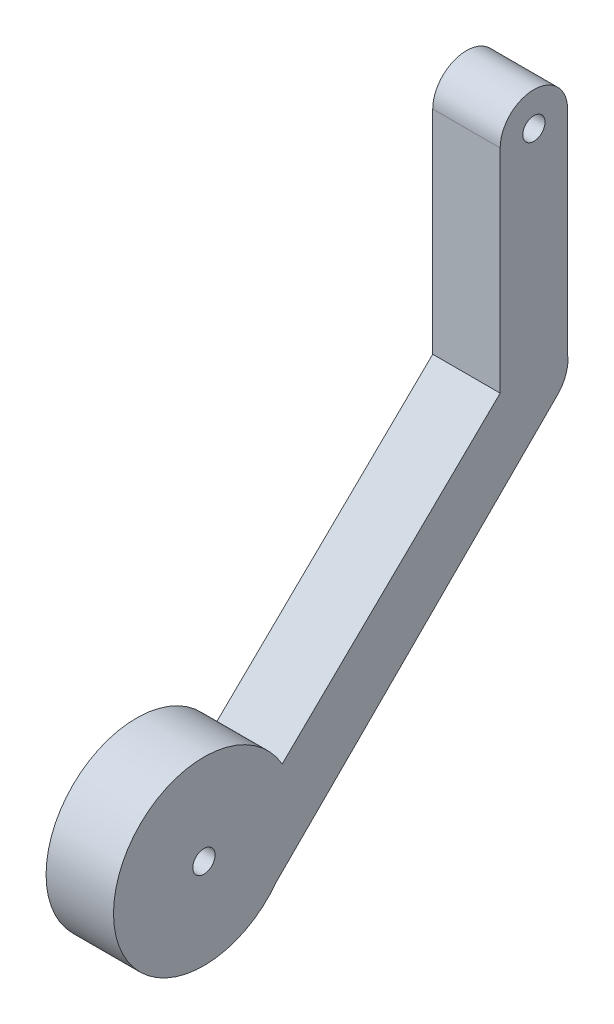
ISO-10303-21;
HEADER;
FILE_DESCRIPTION(('STEP AP214'),'2;1');
FILE_NAME('part.step','',(''),(''),'','','');
FILE_SCHEMA(('AUTOMOTIVE_DESIGN { 1 0 10303 214 1 1 1 1 }'));
ENDSEC;
DATA;
#1=APPLICATION_CONTEXT('core data for automotive mechanical design processes');
#2=APPLICATION_PROTOCOL_DEFINITION('international standard','automotive_design',2000,#1);
#3=PRODUCT_CONTEXT('',#1,'mechanical');
#4=PRODUCT('Part','Part','',(#3));
#5=PRODUCT_RELATED_PRODUCT_CATEGORY('part','',(#4));
#6=PRODUCT_DEFINITION_FORMATION('','',#4);
#7=PRODUCT_DEFINITION_CONTEXT('part definition',#1,'design');
#8=PRODUCT_DEFINITION('design','',#6,#7);
#9=PRODUCT_DEFINITION_SHAPE('','',#8);
#10=(LENGTH_UNIT() NAMED_UNIT(*) SI_UNIT(.MILLI.,.METRE.));
#11=(NAMED_UNIT(*) PLANE_ANGLE_UNIT() SI_UNIT($,.RADIAN.));
#12=(NAMED_UNIT(*) SI_UNIT($,.STERADIAN.) SOLID_ANGLE_UNIT());
#13=UNCERTAINTY_MEASURE_WITH_UNIT(LENGTH_MEASURE(1.E-05),#10,'distance_accuracy_value','');
#14=(GEOMETRIC_REPRESENTATION_CONTEXT(3) GLOBAL_UNCERTAINTY_ASSIGNED_CONTEXT((#13)) GLOBAL_UNIT_ASSIGNED_CONTEXT((#10,
#11,#12)) REPRESENTATION_CONTEXT('',''));
#15=CARTESIAN_POINT('',(0.,0.,0.));
#16=DIRECTION('',(0.,0.,1.));
#17=DIRECTION('',(1.,0.,0.));
#18=AXIS2_PLACEMENT_3D('',#15,#16,#17);
#19=CARTESIAN_POINT('',(66.4159242466974,-53.8689345190493,50.5552745681072));
#20=DIRECTION('',(1.,0.,0.));
#21=DIRECTION('',(0.,0.,-1.));
#22=AXIS2_PLACEMENT_3D('',#19,#20,#21);
#23=PLANE('',#22);
#24=CARTESIAN_POINT('',(66.4159242466974,-21.663090288847,50.2643924418796));
#25=DIRECTION('',(1.,0.,0.));
#26=DIRECTION('',(0.,0.,-1.));
#27=AXIS2_PLACEMENT_3D('',#24,#25,#26);
#28=CIRCLE('',#27,1.65);
#29=CARTESIAN_POINT('',(66.4159242466974,-21.663090288847,48.6143924418796));
#30=VERTEX_POINT('',#29);
#31=EDGE_CURVE('E128',#30,#30,#28,.T.);
#32=ORIENTED_EDGE('',*,*,#31,.F.);
#33=EDGE_LOOP('',(#32));
#34=FACE_BOUND('',#33,.T.);
#35=CARTESIAN_POINT('',(66.4159242466974,-53.8689345190493,50.5552745681072));
#36=DIRECTION('',(1.,0.,0.));
#37=DIRECTION('',(0.,0.,-1.));
#38=AXIS2_PLACEMENT_3D('',#35,#36,#37);
#39=CIRCLE('',#38,5.33901453140242);
#40=CARTESIAN_POINT('',(66.4159242466974,-57.6441878990574,46.7800211880989));
#41=VERTEX_POINT('',#40);
#42=CARTESIAN_POINT('',(66.4159242466974,-53.1536426255599,45.2643924418796));
#43=VERTEX_POINT('',#42);
#44=EDGE_CURVE('E137',#41,#43,#39,.T.);
#45=ORIENTED_EDGE('',*,*,#44,.T.);
#46=DIRECTION('',(0.,1.,0.));
#47=VECTOR('',#46,1.);
#48=CARTESIAN_POINT('',(66.4159242466974,-21.663090288847,45.2643924418796));
#49=LINE('',#48,#47);
#50=CARTESIAN_POINT('',(66.4159242466974,-21.663090288847,45.2643924418796));
#51=VERTEX_POINT('',#50);
#52=EDGE_CURVE('E90',#43,#51,#49,.T.);
#53=ORIENTED_EDGE('',*,*,#52,.T.);
#54=CARTESIAN_POINT('',(66.4159242466974,-21.663090288847,50.2643924418796));
#55=DIRECTION('',(1.,0.,0.));
#56=DIRECTION('',(0.,0.,-1.));
#57=AXIS2_PLACEMENT_3D('',#54,#55,#56);
#58=CIRCLE('',#57,5.);
#59=CARTESIAN_POINT('',(66.4159242466974,-21.663090288847,55.2643924418796));
#60=VERTEX_POINT('',#59);
#61=EDGE_CURVE('E149',#51,#60,#58,.T.);
#62=ORIENTED_EDGE('',*,*,#61,.T.);
#63=DIRECTION('',(0.,-1.,0.));
#64=VECTOR('',#63,1.);
#65=CARTESIAN_POINT('',(66.4159242466974,-21.663090288847,55.2643924418796));
#66=LINE('',#65,#64);
#67=CARTESIAN_POINT('',(66.4159242466974,-53.1536426255599,55.2643924418796));
#68=VERTEX_POINT('',#67);
#69=EDGE_CURVE('E106',#60,#68,#66,.T.);
#70=ORIENTED_EDGE('',*,*,#69,.T.);
#71=DIRECTION('',(0.,-0.697431400188519,0.716651548544397));
#72=VECTOR('',#71,1.);
#73=CARTESIAN_POINT('',(66.4159242466974,-53.1536426255599,55.2643924418796));
#74=LINE('',#73,#72);
#75=CARTESIAN_POINT('',(66.4159242466974,-84.6061686146855,87.5837021971429));
#76=VERTEX_POINT('',#75);
#77=EDGE_CURVE('E100',#68,#76,#74,.T.);
#78=ORIENTED_EDGE('',*,*,#77,.T.);
#79=CARTESIAN_POINT('',(66.4159242466974,-91.3091232544164,99.1903375295028));
#80=DIRECTION('',(1.,0.,0.));
#81=DIRECTION('',(0.,0.,1.));
#82=AXIS2_PLACEMENT_3D('',#79,#80,#81);
#83=CIRCLE('',#82,13.4031184670089);
#84=CARTESIAN_POINT('',(66.4159242466974,-99.2766570863032,88.4124903753437));
#85=VERTEX_POINT('',#84);
#86=EDGE_CURVE('E104',#76,#85,#83,.T.);
#87=ORIENTED_EDGE('',*,*,#86,.T.);
#88=DIRECTION('',(0.,0.707106781186556,-0.707106781186539));
#89=VECTOR('',#88,1.);
#90=CARTESIAN_POINT('',(66.4159242466974,-99.2766570863032,88.4124903753437));
#91=LINE('',#90,#89);
#92=EDGE_CURVE('E50',#85,#41,#91,.T.);
#93=ORIENTED_EDGE('',*,*,#92,.T.);
#94=EDGE_LOOP('',(#45,#53,#62,#70,#78,#87,#93));
#95=FACE_BOUND('',#94,.T.);
#96=CARTESIAN_POINT('',(66.4159242466974,-91.3091232544164,99.1903375295028));
#97=DIRECTION('',(1.,0.,0.));
#98=DIRECTION('',(0.,0.,-1.));
#99=AXIS2_PLACEMENT_3D('',#96,#97,#98);
#100=CIRCLE('',#99,1.65);
#101=CARTESIAN_POINT('',(66.4159242466974,-91.3091232544164,97.5403375295028));
#102=VERTEX_POINT('',#101);
#103=EDGE_CURVE('E164',#102,#102,#100,.T.);
#104=ORIENTED_EDGE('',*,*,#103,.F.);
#105=EDGE_LOOP('',(#104));
#106=FACE_BOUND('',#105,.T.);
#107=ADVANCED_FACE('F33',(#34,#95,#106),#23,.T.);
#108=CARTESIAN_POINT('',(56.4159242466974,-53.8689345190493,50.5552745681072));
#109=DIRECTION('',(1.,0.,0.));
#110=DIRECTION('',(0.,0.,-1.));
#111=AXIS2_PLACEMENT_3D('',#108,#109,#110);
#112=PLANE('',#111);
#113=CARTESIAN_POINT('',(56.4159242466974,-53.8689345190493,50.5552745681072));
#114=DIRECTION('',(1.,0.,0.));
#115=DIRECTION('',(0.,0.,-1.));
#116=AXIS2_PLACEMENT_3D('',#113,#114,#115);
#117=CIRCLE('',#116,5.33901453140242);
#118=CARTESIAN_POINT('',(56.4159242466974,-57.6441878990574,46.7800211880989));
#119=VERTEX_POINT('',#118);
#120=CARTESIAN_POINT('',(56.4159242466974,-53.1536426255599,45.2643924418796));
#121=VERTEX_POINT('',#120);
#122=EDGE_CURVE('E124',#119,#121,#117,.T.);
#123=ORIENTED_EDGE('',*,*,#122,.F.);
#124=DIRECTION('',(0.,0.707106781186556,-0.707106781186539));
#125=VECTOR('',#124,1.);
#126=CARTESIAN_POINT('',(56.4159242466974,-99.2766570863032,88.4124903753437));
#127=LINE('',#126,#125);
#128=CARTESIAN_POINT('',(56.4159242466974,-99.2766570863032,88.4124903753437));
#129=VERTEX_POINT('',#128);
#130=EDGE_CURVE('E82',#129,#119,#127,.T.);
#131=ORIENTED_EDGE('',*,*,#130,.F.);
#132=CARTESIAN_POINT('',(56.4159242466974,-91.3091232544164,99.1903375295028));
#133=DIRECTION('',(1.,0.,0.));
#134=DIRECTION('',(0.,0.,1.));
#135=AXIS2_PLACEMENT_3D('',#132,#133,#134);
#136=CIRCLE('',#135,13.4031184670089);
#137=CARTESIAN_POINT('',(56.4159242466974,-84.6061686146855,87.5837021971429));
#138=VERTEX_POINT('',#137);
#139=EDGE_CURVE('E76',#138,#129,#136,.T.);
#140=ORIENTED_EDGE('',*,*,#139,.F.);
#141=DIRECTION('',(0.,-0.697431400188519,0.716651548544397));
#142=VECTOR('',#141,1.);
#143=CARTESIAN_POINT('',(56.4159242466974,-53.1536426255599,55.2643924418796));
#144=LINE('',#143,#142);
#145=CARTESIAN_POINT('',(56.4159242466974,-53.1536426255599,55.2643924418796));
#146=VERTEX_POINT('',#145);
#147=EDGE_CURVE('E114',#146,#138,#144,.T.);
#148=ORIENTED_EDGE('',*,*,#147,.F.);
#149=DIRECTION('',(0.,-1.,0.));
#150=VECTOR('',#149,1.);
#151=CARTESIAN_POINT('',(56.4159242466974,-21.663090288847,55.2643924418796));
#152=LINE('',#151,#150);
#153=CARTESIAN_POINT('',(56.4159242466974,-21.663090288847,55.2643924418796));
#154=VERTEX_POINT('',#153);
#155=EDGE_CURVE('E132',#154,#146,#152,.T.);
#156=ORIENTED_EDGE('',*,*,#155,.F.);
#157=CARTESIAN_POINT('',(56.4159242466974,-21.663090288847,50.2643924418796));
#158=DIRECTION('',(1.,0.,0.));
#159=DIRECTION('',(0.,0.,-1.));
#160=AXIS2_PLACEMENT_3D('',#157,#158,#159);
#161=CIRCLE('',#160,5.);
#162=CARTESIAN_POINT('',(56.4159242466974,-21.663090288847,45.2643924418796));
#163=VERTEX_POINT('',#162);
#164=EDGE_CURVE('E130',#163,#154,#161,.T.);
#165=ORIENTED_EDGE('',*,*,#164,.F.);
#166=DIRECTION('',(0.,1.,0.));
#167=VECTOR('',#166,1.);
#168=CARTESIAN_POINT('',(56.4159242466974,-21.663090288847,45.2643924418796));
#169=LINE('',#168,#167);
#170=EDGE_CURVE('E127',#121,#163,#169,.T.);
#171=ORIENTED_EDGE('',*,*,#170,.F.);
#172=EDGE_LOOP('',(#123,#131,#140,#148,#156,#165,#171));
#173=FACE_BOUND('',#172,.T.);
#174=CARTESIAN_POINT('',(56.4159242466974,-21.663090288847,50.2643924418796));
#175=DIRECTION('',(1.,0.,0.));
#176=DIRECTION('',(0.,0.,-1.));
#177=AXIS2_PLACEMENT_3D('',#174,#175,#176);
#178=CIRCLE('',#177,1.65);
#179=CARTESIAN_POINT('',(56.4159242466974,-21.663090288847,48.6143924418796));
#180=VERTEX_POINT('',#179);
#181=EDGE_CURVE('E161',#180,#180,#178,.T.);
#182=ORIENTED_EDGE('',*,*,#181,.T.);
#183=EDGE_LOOP('',(#182));
#184=FACE_BOUND('',#183,.T.);
#185=CARTESIAN_POINT('',(56.4159242466974,-91.3091232544164,99.1903375295028));
#186=DIRECTION('',(1.,0.,0.));
#187=DIRECTION('',(0.,0.,-1.));
#188=AXIS2_PLACEMENT_3D('',#185,#186,#187);
#189=CIRCLE('',#188,1.65);
#190=CARTESIAN_POINT('',(56.4159242466974,-91.3091232544164,97.5403375295028));
#191=VERTEX_POINT('',#190);
#192=EDGE_CURVE('E167',#191,#191,#189,.T.);
#193=ORIENTED_EDGE('',*,*,#192,.T.);
#194=EDGE_LOOP('',(#193));
#195=FACE_BOUND('',#194,.T.);
#196=ADVANCED_FACE('F153',(#173,#184,#195),#112,.F.);
#197=CARTESIAN_POINT('',(66.4159242466974,-53.8689345190493,50.5552745681072));
#198=DIRECTION('',(-1.,0.,0.));
#199=DIRECTION('',(0.,0.,1.));
#200=AXIS2_PLACEMENT_3D('',#197,#198,#199);
#201=CYLINDRICAL_SURFACE('',#200,5.33901453140242);
#202=ORIENTED_EDGE('',*,*,#122,.T.);
#203=DIRECTION('',(-1.,0.,0.));
#204=VECTOR('',#203,1.);
#205=CARTESIAN_POINT('',(66.4159242466974,-53.1536426255599,45.2643924418796));
#206=LINE('',#205,#204);
#207=EDGE_CURVE('E11',#43,#121,#206,.T.);
#208=ORIENTED_EDGE('',*,*,#207,.F.);
#209=ORIENTED_EDGE('',*,*,#44,.F.);
#210=DIRECTION('',(-1.,0.,0.));
#211=VECTOR('',#210,1.);
#212=CARTESIAN_POINT('',(66.4159242466974,-57.6441878990574,46.7800211880989));
#213=LINE('',#212,#211);
#214=EDGE_CURVE('E120',#41,#119,#213,.T.);
#215=ORIENTED_EDGE('',*,*,#214,.T.);
#216=EDGE_LOOP('',(#202,#208,#209,#215));
#217=FACE_BOUND('',#216,.T.);
#218=ADVANCED_FACE('F35',(#217),#201,.T.);
#219=CARTESIAN_POINT('',(66.4159242466974,-21.663090288847,45.2643924418796));
#220=DIRECTION('',(0.,0.,1.));
#221=DIRECTION('',(0.,-1.,0.));
#222=AXIS2_PLACEMENT_3D('',#219,#220,#221);
#223=PLANE('',#222);
#224=ORIENTED_EDGE('',*,*,#170,.T.);
#225=DIRECTION('',(-1.,0.,0.));
#226=VECTOR('',#225,1.);
#227=CARTESIAN_POINT('',(66.4159242466974,-21.663090288847,45.2643924418796));
#228=LINE('',#227,#226);
#229=EDGE_CURVE('E42',#51,#163,#228,.T.);
#230=ORIENTED_EDGE('',*,*,#229,.F.);
#231=ORIENTED_EDGE('',*,*,#52,.F.);
#232=ORIENTED_EDGE('',*,*,#207,.T.);
#233=EDGE_LOOP('',(#224,#230,#231,#232));
#234=FACE_BOUND('',#233,.T.);
#235=ADVANCED_FACE('F197',(#234),#223,.F.);
#236=CARTESIAN_POINT('',(66.4159242466974,-21.663090288847,50.2643924418796));
#237=DIRECTION('',(-1.,0.,0.));
#238=DIRECTION('',(0.,0.,1.));
#239=AXIS2_PLACEMENT_3D('',#236,#237,#238);
#240=CYLINDRICAL_SURFACE('',#239,5.);
#241=ORIENTED_EDGE('',*,*,#164,.T.);
#242=DIRECTION('',(-1.,0.,0.));
#243=VECTOR('',#242,1.);
#244=CARTESIAN_POINT('',(66.4159242466974,-21.663090288847,55.2643924418796));
#245=LINE('',#244,#243);
#246=EDGE_CURVE('E141',#60,#154,#245,.T.);
#247=ORIENTED_EDGE('',*,*,#246,.F.);
#248=ORIENTED_EDGE('',*,*,#61,.F.);
#249=ORIENTED_EDGE('',*,*,#229,.T.);
#250=EDGE_LOOP('',(#241,#247,#248,#249));
#251=FACE_BOUND('',#250,.T.);
#252=ADVANCED_FACE('F147',(#251),#240,.T.);
#253=CARTESIAN_POINT('',(66.4159242466974,-21.663090288847,55.2643924418796));
#254=DIRECTION('',(0.,0.,-1.));
#255=DIRECTION('',(0.,1.,0.));
#256=AXIS2_PLACEMENT_3D('',#253,#254,#255);
#257=PLANE('',#256);
#258=ORIENTED_EDGE('',*,*,#155,.T.);
#259=DIRECTION('',(-1.,0.,0.));
#260=VECTOR('',#259,1.);
#261=CARTESIAN_POINT('',(66.4159242466974,-53.1536426255599,55.2643924418796));
#262=LINE('',#261,#260);
#263=EDGE_CURVE('E115',#68,#146,#262,.T.);
#264=ORIENTED_EDGE('',*,*,#263,.F.);
#265=ORIENTED_EDGE('',*,*,#69,.F.);
#266=ORIENTED_EDGE('',*,*,#246,.T.);
#267=EDGE_LOOP('',(#258,#264,#265,#266));
#268=FACE_BOUND('',#267,.T.);
#269=ADVANCED_FACE('F156',(#268),#257,.F.);
#270=CARTESIAN_POINT('',(66.4159242466974,-53.1536426255599,55.2643924418796));
#271=DIRECTION('',(0.,-0.716651548544397,-0.697431400188519));
#272=DIRECTION('',(0.,0.697431400188519,-0.716651548544397));
#273=AXIS2_PLACEMENT_3D('',#270,#271,#272);
#274=PLANE('',#273);
#275=ORIENTED_EDGE('',*,*,#147,.T.);
#276=DIRECTION('',(-1.,0.,0.));
#277=VECTOR('',#276,1.);
#278=CARTESIAN_POINT('',(66.4159242466974,-84.6061686146855,87.5837021971429));
#279=LINE('',#278,#277);
#280=EDGE_CURVE('E111',#76,#138,#279,.T.);
#281=ORIENTED_EDGE('',*,*,#280,.F.);
#282=ORIENTED_EDGE('',*,*,#77,.F.);
#283=ORIENTED_EDGE('',*,*,#263,.T.);
#284=EDGE_LOOP('',(#275,#281,#282,#283));
#285=FACE_BOUND('',#284,.T.);
#286=ADVANCED_FACE('F112',(#285),#274,.F.);
#287=CARTESIAN_POINT('',(66.4159242466974,-91.3091232544164,99.1903375295028));
#288=DIRECTION('',(-1.,0.,0.));
#289=DIRECTION('',(0.,0.,1.));
#290=AXIS2_PLACEMENT_3D('',#287,#288,#289);
#291=CYLINDRICAL_SURFACE('',#290,13.4031184670089);
#292=ORIENTED_EDGE('',*,*,#139,.T.);
#293=DIRECTION('',(-1.,0.,0.));
#294=VECTOR('',#293,1.);
#295=CARTESIAN_POINT('',(66.4159242466974,-99.2766570863032,88.4124903753437));
#296=LINE('',#295,#294);
#297=EDGE_CURVE('E116',#85,#129,#296,.T.);
#298=ORIENTED_EDGE('',*,*,#297,.F.);
#299=ORIENTED_EDGE('',*,*,#86,.F.);
#300=ORIENTED_EDGE('',*,*,#280,.T.);
#301=EDGE_LOOP('',(#292,#298,#299,#300));
#302=FACE_BOUND('',#301,.T.);
#303=ADVANCED_FACE('F118',(#302),#291,.T.);
#304=CARTESIAN_POINT('',(66.4159242466974,-99.2766570863032,88.4124903753437));
#305=DIRECTION('',(0.,0.707106781186539,0.707106781186556));
#306=DIRECTION('',(0.,-0.707106781186556,0.707106781186539));
#307=AXIS2_PLACEMENT_3D('',#304,#305,#306);
#308=PLANE('',#307);
#309=ORIENTED_EDGE('',*,*,#130,.T.);
#310=ORIENTED_EDGE('',*,*,#214,.F.);
#311=ORIENTED_EDGE('',*,*,#92,.F.);
#312=ORIENTED_EDGE('',*,*,#297,.T.);
#313=EDGE_LOOP('',(#309,#310,#311,#312));
#314=FACE_BOUND('',#313,.T.);
#315=ADVANCED_FACE('F187',(#314),#308,.F.);
#316=CARTESIAN_POINT('',(66.4159242466974,-21.663090288847,50.2643924418796));
#317=DIRECTION('',(-1.,0.,0.));
#318=DIRECTION('',(0.,0.,1.));
#319=AXIS2_PLACEMENT_3D('',#316,#317,#318);
#320=CYLINDRICAL_SURFACE('',#319,1.65);
#321=ORIENTED_EDGE('',*,*,#31,.T.);
#322=EDGE_LOOP('',(#321));
#323=FACE_BOUND('',#322,.T.);
#324=ORIENTED_EDGE('',*,*,#181,.F.);
#325=EDGE_LOOP('',(#324));
#326=FACE_BOUND('',#325,.T.);
#327=ADVANCED_FACE('F184',(#323,#326),#320,.F.);
#328=CARTESIAN_POINT('',(66.4159242466974,-91.3091232544164,99.1903375295028));
#329=DIRECTION('',(-1.,0.,0.));
#330=DIRECTION('',(0.,0.,1.));
#331=AXIS2_PLACEMENT_3D('',#328,#329,#330);
#332=CYLINDRICAL_SURFACE('',#331,1.65);
#333=ORIENTED_EDGE('',*,*,#103,.T.);
#334=EDGE_LOOP('',(#333));
#335=FACE_BOUND('',#334,.T.);
#336=ORIENTED_EDGE('',*,*,#192,.F.);
#337=EDGE_LOOP('',(#336));
#338=FACE_BOUND('',#337,.T.);
#339=ADVANCED_FACE('F173',(#335,#338),#332,.F.);
#340=CLOSED_SHELL('',(#107,#196,#218,#235,#252,#269,#286,#303,#315,#327,#339));
#341=MANIFOLD_SOLID_BREP('B2',#340);
#342=ADVANCED_BREP_SHAPE_REPRESENTATION('',(#18,#341),#14);
#343=SHAPE_DEFINITION_REPRESENTATION(#9,#342);
ENDSEC;
END-ISO-10303-21;
